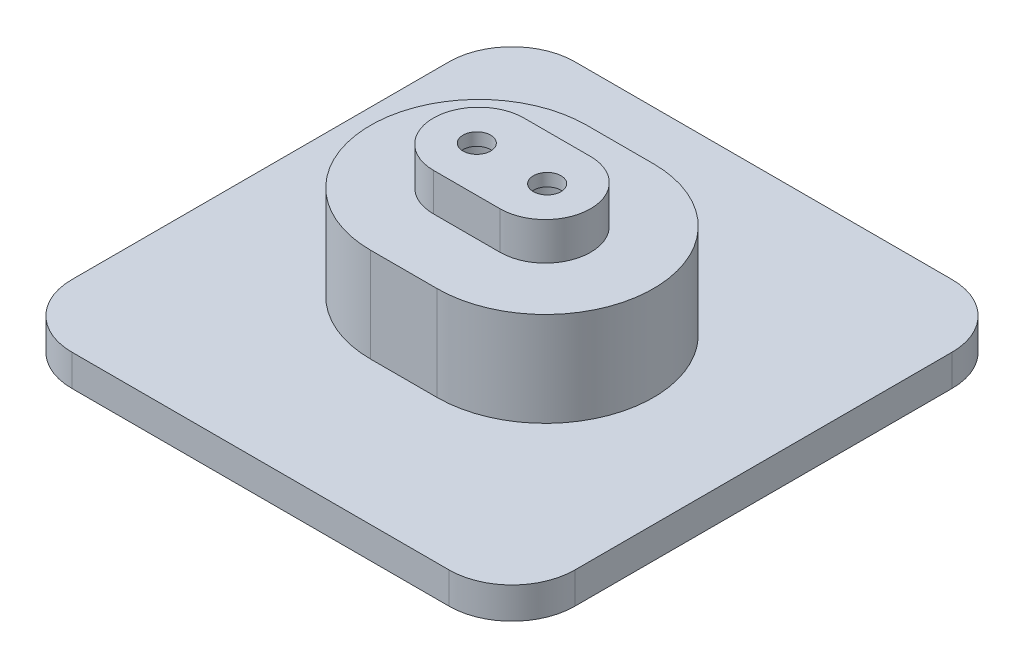
ISO-10303-21;
HEADER;
FILE_DESCRIPTION(('STEP AP214'),'2;1');
FILE_NAME('part.step','',(''),(''),'','','');
FILE_SCHEMA(('AUTOMOTIVE_DESIGN { 1 0 10303 214 1 1 1 1 }'));
ENDSEC;
DATA;
#1=APPLICATION_CONTEXT('core data for automotive mechanical design processes');
#2=APPLICATION_PROTOCOL_DEFINITION('international standard','automotive_design',2000,#1);
#3=PRODUCT_CONTEXT('',#1,'mechanical');
#4=PRODUCT('Part','Part','',(#3));
#5=PRODUCT_RELATED_PRODUCT_CATEGORY('part','',(#4));
#6=PRODUCT_DEFINITION_FORMATION('','',#4);
#7=PRODUCT_DEFINITION_CONTEXT('part definition',#1,'design');
#8=PRODUCT_DEFINITION('design','',#6,#7);
#9=PRODUCT_DEFINITION_SHAPE('','',#8);
#10=(LENGTH_UNIT() NAMED_UNIT(*) SI_UNIT(.MILLI.,.METRE.));
#11=(NAMED_UNIT(*) PLANE_ANGLE_UNIT() SI_UNIT($,.RADIAN.));
#12=(NAMED_UNIT(*) SI_UNIT($,.STERADIAN.) SOLID_ANGLE_UNIT());
#13=UNCERTAINTY_MEASURE_WITH_UNIT(LENGTH_MEASURE(1.E-05),#10,'distance_accuracy_value','');
#14=(GEOMETRIC_REPRESENTATION_CONTEXT(3) GLOBAL_UNCERTAINTY_ASSIGNED_CONTEXT((#13)) GLOBAL_UNIT_ASSIGNED_CONTEXT((#10,
#11,#12)) REPRESENTATION_CONTEXT('',''));
#15=CARTESIAN_POINT('',(0.,0.,0.));
#16=DIRECTION('',(0.,0.,1.));
#17=DIRECTION('',(1.,0.,0.));
#18=AXIS2_PLACEMENT_3D('',#15,#16,#17);
#19=CARTESIAN_POINT('',(-5.595,-1.00000000000001,0.));
#20=DIRECTION('',(0.,1.,0.));
#21=DIRECTION('',(0.,0.,1.));
#22=AXIS2_PLACEMENT_3D('',#19,#20,#21);
#23=CYLINDRICAL_SURFACE('',#22,2.2);
#24=CARTESIAN_POINT('',(-5.595,26.,0.));
#25=DIRECTION('',(0.,1.,0.));
#26=DIRECTION('',(0.,0.,1.));
#27=AXIS2_PLACEMENT_3D('',#24,#25,#26);
#28=CIRCLE('',#27,2.2);
#29=CARTESIAN_POINT('',(-5.595,26.,2.2));
#30=VERTEX_POINT('',#29);
#31=EDGE_CURVE('E337',#30,#30,#28,.T.);
#32=ORIENTED_EDGE('',*,*,#31,.T.);
#33=EDGE_LOOP('',(#32));
#34=FACE_BOUND('',#33,.T.);
#35=CARTESIAN_POINT('',(-5.595,24.,0.));
#36=DIRECTION('',(0.,-1.,0.));
#37=DIRECTION('',(0.,0.,-1.));
#38=AXIS2_PLACEMENT_3D('',#35,#36,#37);
#39=CIRCLE('',#38,2.2);
#40=CARTESIAN_POINT('',(-5.595,24.,-2.2));
#41=VERTEX_POINT('',#40);
#42=EDGE_CURVE('E53',#41,#41,#39,.F.);
#43=ORIENTED_EDGE('',*,*,#42,.F.);
#44=EDGE_LOOP('',(#43));
#45=FACE_BOUND('',#44,.T.);
#46=ADVANCED_FACE('F49',(#34,#45),#23,.F.);
#47=CARTESIAN_POINT('',(5.595,-1.00000000000001,0.));
#48=DIRECTION('',(0.,1.,0.));
#49=DIRECTION('',(0.,0.,1.));
#50=AXIS2_PLACEMENT_3D('',#47,#48,#49);
#51=CYLINDRICAL_SURFACE('',#50,2.2);
#52=CARTESIAN_POINT('',(5.595,26.,0.));
#53=DIRECTION('',(0.,1.,0.));
#54=DIRECTION('',(0.,0.,1.));
#55=AXIS2_PLACEMENT_3D('',#52,#53,#54);
#56=CIRCLE('',#55,2.2);
#57=CARTESIAN_POINT('',(5.595,26.,2.2));
#58=VERTEX_POINT('',#57);
#59=EDGE_CURVE('E189',#58,#58,#56,.T.);
#60=ORIENTED_EDGE('',*,*,#59,.T.);
#61=EDGE_LOOP('',(#60));
#62=FACE_BOUND('',#61,.T.);
#63=CARTESIAN_POINT('',(5.595,24.,0.));
#64=DIRECTION('',(0.,-1.,0.));
#65=DIRECTION('',(0.,0.,-1.));
#66=AXIS2_PLACEMENT_3D('',#63,#64,#65);
#67=CIRCLE('',#66,2.2);
#68=CARTESIAN_POINT('',(5.595,24.,-2.2));
#69=VERTEX_POINT('',#68);
#70=EDGE_CURVE('E328',#69,#69,#67,.F.);
#71=ORIENTED_EDGE('',*,*,#70,.F.);
#72=EDGE_LOOP('',(#71));
#73=FACE_BOUND('',#72,.T.);
#74=ADVANCED_FACE('F391',(#62,#73),#51,.F.);
#75=CARTESIAN_POINT('',(-30.,5.,30.));
#76=DIRECTION('',(0.,-1.,0.));
#77=DIRECTION('',(0.,0.,-1.));
#78=AXIS2_PLACEMENT_3D('',#75,#76,#77);
#79=PLANE('',#78);
#80=CARTESIAN_POINT('',(-30.,5.,30.));
#81=DIRECTION('',(0.,1.,0.));
#82=DIRECTION('',(0.,0.,-1.));
#83=AXIS2_PLACEMENT_3D('',#80,#81,#82);
#84=CIRCLE('',#83,10.);
#85=CARTESIAN_POINT('',(-40.,5.,29.9999999999999));
#86=VERTEX_POINT('',#85);
#87=CARTESIAN_POINT('',(-29.9999999999999,5.,40.));
#88=VERTEX_POINT('',#87);
#89=EDGE_CURVE('E253',#86,#88,#84,.T.);
#90=ORIENTED_EDGE('',*,*,#89,.T.);
#91=DIRECTION('',(1.,0.,0.));
#92=VECTOR('',#91,1.);
#93=CARTESIAN_POINT('',(29.9999999999999,5.,40.));
#94=LINE('',#93,#92);
#95=CARTESIAN_POINT('',(29.9999999999999,5.,40.));
#96=VERTEX_POINT('',#95);
#97=EDGE_CURVE('E257',#88,#96,#94,.T.);
#98=ORIENTED_EDGE('',*,*,#97,.T.);
#99=CARTESIAN_POINT('',(30.,5.,30.));
#100=DIRECTION('',(0.,1.,0.));
#101=DIRECTION('',(0.,0.,1.));
#102=AXIS2_PLACEMENT_3D('',#99,#100,#101);
#103=CIRCLE('',#102,10.);
#104=CARTESIAN_POINT('',(40.,5.,29.9999999999999));
#105=VERTEX_POINT('',#104);
#106=EDGE_CURVE('E261',#96,#105,#103,.T.);
#107=ORIENTED_EDGE('',*,*,#106,.T.);
#108=DIRECTION('',(0.,0.,-1.));
#109=VECTOR('',#108,1.);
#110=CARTESIAN_POINT('',(40.,5.,29.9999999999999));
#111=LINE('',#110,#109);
#112=CARTESIAN_POINT('',(40.,5.,-29.9999999999999));
#113=VERTEX_POINT('',#112);
#114=EDGE_CURVE('E264',#105,#113,#111,.T.);
#115=ORIENTED_EDGE('',*,*,#114,.T.);
#116=CARTESIAN_POINT('',(30.,5.,-30.));
#117=DIRECTION('',(0.,1.,0.));
#118=DIRECTION('',(0.,0.,1.));
#119=AXIS2_PLACEMENT_3D('',#116,#117,#118);
#120=CIRCLE('',#119,10.);
#121=CARTESIAN_POINT('',(29.9999999999999,5.,-40.));
#122=VERTEX_POINT('',#121);
#123=EDGE_CURVE('E267',#113,#122,#120,.T.);
#124=ORIENTED_EDGE('',*,*,#123,.T.);
#125=DIRECTION('',(-1.,0.,0.));
#126=VECTOR('',#125,1.);
#127=CARTESIAN_POINT('',(29.9999999999999,5.,-40.));
#128=LINE('',#127,#126);
#129=CARTESIAN_POINT('',(-29.9999999999999,5.,-40.));
#130=VERTEX_POINT('',#129);
#131=EDGE_CURVE('E270',#122,#130,#128,.T.);
#132=ORIENTED_EDGE('',*,*,#131,.T.);
#133=CARTESIAN_POINT('',(-30.,5.,-30.));
#134=DIRECTION('',(0.,1.,0.));
#135=DIRECTION('',(0.,0.,1.));
#136=AXIS2_PLACEMENT_3D('',#133,#134,#135);
#137=CIRCLE('',#136,10.);
#138=CARTESIAN_POINT('',(-40.,5.,-29.9999999999999));
#139=VERTEX_POINT('',#138);
#140=EDGE_CURVE('E273',#130,#139,#137,.T.);
#141=ORIENTED_EDGE('',*,*,#140,.T.);
#142=DIRECTION('',(0.,0.,1.));
#143=VECTOR('',#142,1.);
#144=CARTESIAN_POINT('',(-40.,5.,29.9999999999999));
#145=LINE('',#144,#143);
#146=EDGE_CURVE('E276',#139,#86,#145,.T.);
#147=ORIENTED_EDGE('',*,*,#146,.T.);
#148=EDGE_LOOP('',(#90,#98,#107,#115,#124,#132,#141,#147));
#149=FACE_BOUND('',#148,.T.);
#150=CARTESIAN_POINT('',(-5.29954084048259,5.,0.));
#151=DIRECTION('',(0.,1.,0.));
#152=DIRECTION('',(0.,0.,1.));
#153=AXIS2_PLACEMENT_3D('',#150,#151,#152);
#154=CIRCLE('',#153,17.2004591595174);
#155=CARTESIAN_POINT('',(-5.29954084048259,5.,-17.2004591595174));
#156=VERTEX_POINT('',#155);
#157=CARTESIAN_POINT('',(-5.29954084048259,5.,17.2004591595174));
#158=VERTEX_POINT('',#157);
#159=EDGE_CURVE('E221',#156,#158,#154,.T.);
#160=ORIENTED_EDGE('',*,*,#159,.F.);
#161=DIRECTION('',(-1.,0.,0.));
#162=VECTOR('',#161,1.);
#163=CARTESIAN_POINT('',(5.29954084048259,5.,-17.2004591595174));
#164=LINE('',#163,#162);
#165=CARTESIAN_POINT('',(5.29954084048259,5.,-17.2004591595174));
#166=VERTEX_POINT('',#165);
#167=EDGE_CURVE('E211',#166,#156,#164,.T.);
#168=ORIENTED_EDGE('',*,*,#167,.F.);
#169=CARTESIAN_POINT('',(5.29954084048259,5.,0.));
#170=DIRECTION('',(0.,1.,0.));
#171=DIRECTION('',(0.,0.,1.));
#172=AXIS2_PLACEMENT_3D('',#169,#170,#171);
#173=CIRCLE('',#172,17.2004591595174);
#174=CARTESIAN_POINT('',(5.29954084048259,5.,17.2004591595174));
#175=VERTEX_POINT('',#174);
#176=EDGE_CURVE('E230',#175,#166,#173,.T.);
#177=ORIENTED_EDGE('',*,*,#176,.F.);
#178=DIRECTION('',(1.,0.,0.));
#179=VECTOR('',#178,1.);
#180=CARTESIAN_POINT('',(-5.29954084048259,5.,17.2004591595174));
#181=LINE('',#180,#179);
#182=EDGE_CURVE('E225',#158,#175,#181,.T.);
#183=ORIENTED_EDGE('',*,*,#182,.F.);
#184=EDGE_LOOP('',(#160,#168,#177,#183));
#185=FACE_BOUND('',#184,.T.);
#186=ADVANCED_FACE('F396',(#149,#185),#79,.F.);
#187=CARTESIAN_POINT('',(-30.,5.,30.));
#188=DIRECTION('',(0.,-1.,0.));
#189=DIRECTION('',(0.,0.,-1.));
#190=AXIS2_PLACEMENT_3D('',#187,#188,#189);
#191=CYLINDRICAL_SURFACE('',#190,10.);
#192=CARTESIAN_POINT('',(-30.,0.,30.));
#193=DIRECTION('',(0.,1.,0.));
#194=DIRECTION('',(0.,0.,-1.));
#195=AXIS2_PLACEMENT_3D('',#192,#193,#194);
#196=CIRCLE('',#195,10.);
#197=CARTESIAN_POINT('',(-40.,0.,29.9999999999999));
#198=VERTEX_POINT('',#197);
#199=CARTESIAN_POINT('',(-29.9999999999999,0.,40.));
#200=VERTEX_POINT('',#199);
#201=EDGE_CURVE('E252',#198,#200,#196,.T.);
#202=ORIENTED_EDGE('',*,*,#201,.T.);
#203=DIRECTION('',(0.,-1.,0.));
#204=VECTOR('',#203,1.);
#205=CARTESIAN_POINT('',(-29.9999999999999,5.,40.));
#206=LINE('',#205,#204);
#207=EDGE_CURVE('E12',#88,#200,#206,.T.);
#208=ORIENTED_EDGE('',*,*,#207,.F.);
#209=ORIENTED_EDGE('',*,*,#89,.F.);
#210=DIRECTION('',(0.,-1.,0.));
#211=VECTOR('',#210,1.);
#212=CARTESIAN_POINT('',(-40.,5.,29.9999999999999));
#213=LINE('',#212,#211);
#214=EDGE_CURVE('E279',#86,#198,#213,.T.);
#215=ORIENTED_EDGE('',*,*,#214,.T.);
#216=EDGE_LOOP('',(#202,#208,#209,#215));
#217=FACE_BOUND('',#216,.T.);
#218=ADVANCED_FACE('F51',(#217),#191,.T.);
#219=CARTESIAN_POINT('',(29.9999999999999,5.,40.));
#220=DIRECTION('',(0.,0.,-1.));
#221=DIRECTION('',(-1.,0.,0.));
#222=AXIS2_PLACEMENT_3D('',#219,#220,#221);
#223=PLANE('',#222);
#224=DIRECTION('',(1.,0.,0.));
#225=VECTOR('',#224,1.);
#226=CARTESIAN_POINT('',(29.9999999999999,0.,40.));
#227=LINE('',#226,#225);
#228=CARTESIAN_POINT('',(29.9999999999999,0.,40.));
#229=VERTEX_POINT('',#228);
#230=EDGE_CURVE('E283',#200,#229,#227,.T.);
#231=ORIENTED_EDGE('',*,*,#230,.T.);
#232=DIRECTION('',(0.,-1.,0.));
#233=VECTOR('',#232,1.);
#234=CARTESIAN_POINT('',(29.9999999999999,5.,40.));
#235=LINE('',#234,#233);
#236=EDGE_CURVE('E59',#96,#229,#235,.T.);
#237=ORIENTED_EDGE('',*,*,#236,.F.);
#238=ORIENTED_EDGE('',*,*,#97,.F.);
#239=ORIENTED_EDGE('',*,*,#207,.T.);
#240=EDGE_LOOP('',(#231,#237,#238,#239));
#241=FACE_BOUND('',#240,.T.);
#242=ADVANCED_FACE('F458',(#241),#223,.F.);
#243=CARTESIAN_POINT('',(30.,5.,30.));
#244=DIRECTION('',(0.,-1.,0.));
#245=DIRECTION('',(0.,0.,-1.));
#246=AXIS2_PLACEMENT_3D('',#243,#244,#245);
#247=CYLINDRICAL_SURFACE('',#246,10.);
#248=CARTESIAN_POINT('',(30.,0.,30.));
#249=DIRECTION('',(0.,1.,0.));
#250=DIRECTION('',(0.,0.,1.));
#251=AXIS2_PLACEMENT_3D('',#248,#249,#250);
#252=CIRCLE('',#251,10.);
#253=CARTESIAN_POINT('',(40.,0.,29.9999999999999));
#254=VERTEX_POINT('',#253);
#255=EDGE_CURVE('E286',#229,#254,#252,.T.);
#256=ORIENTED_EDGE('',*,*,#255,.T.);
#257=DIRECTION('',(0.,-1.,0.));
#258=VECTOR('',#257,1.);
#259=CARTESIAN_POINT('',(40.,5.,29.9999999999999));
#260=LINE('',#259,#258);
#261=EDGE_CURVE('E322',#105,#254,#260,.T.);
#262=ORIENTED_EDGE('',*,*,#261,.F.);
#263=ORIENTED_EDGE('',*,*,#106,.F.);
#264=ORIENTED_EDGE('',*,*,#236,.T.);
#265=EDGE_LOOP('',(#256,#262,#263,#264));
#266=FACE_BOUND('',#265,.T.);
#267=ADVANCED_FACE('F454',(#266),#247,.T.);
#268=CARTESIAN_POINT('',(40.,5.,29.9999999999999));
#269=DIRECTION('',(-1.,0.,0.));
#270=DIRECTION('',(0.,0.,1.));
#271=AXIS2_PLACEMENT_3D('',#268,#269,#270);
#272=PLANE('',#271);
#273=DIRECTION('',(0.,0.,-1.));
#274=VECTOR('',#273,1.);
#275=CARTESIAN_POINT('',(40.,0.,29.9999999999999));
#276=LINE('',#275,#274);
#277=CARTESIAN_POINT('',(40.,0.,-29.9999999999999));
#278=VERTEX_POINT('',#277);
#279=EDGE_CURVE('E289',#254,#278,#276,.T.);
#280=ORIENTED_EDGE('',*,*,#279,.T.);
#281=DIRECTION('',(0.,-1.,0.));
#282=VECTOR('',#281,1.);
#283=CARTESIAN_POINT('',(40.,5.,-29.9999999999999));
#284=LINE('',#283,#282);
#285=EDGE_CURVE('E318',#113,#278,#284,.T.);
#286=ORIENTED_EDGE('',*,*,#285,.F.);
#287=ORIENTED_EDGE('',*,*,#114,.F.);
#288=ORIENTED_EDGE('',*,*,#261,.T.);
#289=EDGE_LOOP('',(#280,#286,#287,#288));
#290=FACE_BOUND('',#289,.T.);
#291=ADVANCED_FACE('F451',(#290),#272,.F.);
#292=CARTESIAN_POINT('',(30.,5.,-30.));
#293=DIRECTION('',(0.,-1.,0.));
#294=DIRECTION('',(0.,0.,-1.));
#295=AXIS2_PLACEMENT_3D('',#292,#293,#294);
#296=CYLINDRICAL_SURFACE('',#295,10.);
#297=CARTESIAN_POINT('',(30.,0.,-30.));
#298=DIRECTION('',(0.,1.,0.));
#299=DIRECTION('',(0.,0.,1.));
#300=AXIS2_PLACEMENT_3D('',#297,#298,#299);
#301=CIRCLE('',#300,10.);
#302=CARTESIAN_POINT('',(29.9999999999999,0.,-40.));
#303=VERTEX_POINT('',#302);
#304=EDGE_CURVE('E292',#278,#303,#301,.T.);
#305=ORIENTED_EDGE('',*,*,#304,.T.);
#306=DIRECTION('',(0.,-1.,0.));
#307=VECTOR('',#306,1.);
#308=CARTESIAN_POINT('',(29.9999999999999,5.,-40.));
#309=LINE('',#308,#307);
#310=EDGE_CURVE('E314',#122,#303,#309,.T.);
#311=ORIENTED_EDGE('',*,*,#310,.F.);
#312=ORIENTED_EDGE('',*,*,#123,.F.);
#313=ORIENTED_EDGE('',*,*,#285,.T.);
#314=EDGE_LOOP('',(#305,#311,#312,#313));
#315=FACE_BOUND('',#314,.T.);
#316=ADVANCED_FACE('F447',(#315),#296,.T.);
#317=CARTESIAN_POINT('',(29.9999999999999,5.,-40.));
#318=DIRECTION('',(0.,0.,1.));
#319=DIRECTION('',(1.,0.,0.));
#320=AXIS2_PLACEMENT_3D('',#317,#318,#319);
#321=PLANE('',#320);
#322=DIRECTION('',(-1.,0.,0.));
#323=VECTOR('',#322,1.);
#324=CARTESIAN_POINT('',(29.9999999999999,0.,-40.));
#325=LINE('',#324,#323);
#326=CARTESIAN_POINT('',(-29.9999999999999,0.,-40.));
#327=VERTEX_POINT('',#326);
#328=EDGE_CURVE('E295',#303,#327,#325,.T.);
#329=ORIENTED_EDGE('',*,*,#328,.T.);
#330=DIRECTION('',(0.,-1.,0.));
#331=VECTOR('',#330,1.);
#332=CARTESIAN_POINT('',(-29.9999999999999,5.,-40.));
#333=LINE('',#332,#331);
#334=EDGE_CURVE('E310',#130,#327,#333,.T.);
#335=ORIENTED_EDGE('',*,*,#334,.F.);
#336=ORIENTED_EDGE('',*,*,#131,.F.);
#337=ORIENTED_EDGE('',*,*,#310,.T.);
#338=EDGE_LOOP('',(#329,#335,#336,#337));
#339=FACE_BOUND('',#338,.T.);
#340=ADVANCED_FACE('F442',(#339),#321,.F.);
#341=CARTESIAN_POINT('',(-30.,5.,-30.));
#342=DIRECTION('',(0.,-1.,0.));
#343=DIRECTION('',(0.,0.,-1.));
#344=AXIS2_PLACEMENT_3D('',#341,#342,#343);
#345=CYLINDRICAL_SURFACE('',#344,10.);
#346=CARTESIAN_POINT('',(-30.,0.,-30.));
#347=DIRECTION('',(0.,1.,0.));
#348=DIRECTION('',(0.,0.,1.));
#349=AXIS2_PLACEMENT_3D('',#346,#347,#348);
#350=CIRCLE('',#349,10.);
#351=CARTESIAN_POINT('',(-40.,0.,-29.9999999999999));
#352=VERTEX_POINT('',#351);
#353=EDGE_CURVE('E298',#327,#352,#350,.T.);
#354=ORIENTED_EDGE('',*,*,#353,.T.);
#355=DIRECTION('',(0.,-1.,0.));
#356=VECTOR('',#355,1.);
#357=CARTESIAN_POINT('',(-40.,5.,-29.9999999999999));
#358=LINE('',#357,#356);
#359=EDGE_CURVE('E306',#139,#352,#358,.T.);
#360=ORIENTED_EDGE('',*,*,#359,.F.);
#361=ORIENTED_EDGE('',*,*,#140,.F.);
#362=ORIENTED_EDGE('',*,*,#334,.T.);
#363=EDGE_LOOP('',(#354,#360,#361,#362));
#364=FACE_BOUND('',#363,.T.);
#365=ADVANCED_FACE('F436',(#364),#345,.T.);
#366=CARTESIAN_POINT('',(-40.,5.,29.9999999999999));
#367=DIRECTION('',(1.,0.,0.));
#368=DIRECTION('',(0.,0.,-1.));
#369=AXIS2_PLACEMENT_3D('',#366,#367,#368);
#370=PLANE('',#369);
#371=DIRECTION('',(0.,0.,1.));
#372=VECTOR('',#371,1.);
#373=CARTESIAN_POINT('',(-40.,0.,29.9999999999999));
#374=LINE('',#373,#372);
#375=EDGE_CURVE('E258',#352,#198,#374,.T.);
#376=ORIENTED_EDGE('',*,*,#375,.T.);
#377=ORIENTED_EDGE('',*,*,#214,.F.);
#378=ORIENTED_EDGE('',*,*,#146,.F.);
#379=ORIENTED_EDGE('',*,*,#359,.T.);
#380=EDGE_LOOP('',(#376,#377,#378,#379));
#381=FACE_BOUND('',#380,.T.);
#382=ADVANCED_FACE('F419',(#381),#370,.F.);
#383=CARTESIAN_POINT('',(-30.,0.,30.));
#384=DIRECTION('',(0.,-1.,0.));
#385=DIRECTION('',(0.,0.,-1.));
#386=AXIS2_PLACEMENT_3D('',#383,#384,#385);
#387=PLANE('',#386);
#388=CARTESIAN_POINT('',(5.595,0.,0.));
#389=DIRECTION('',(0.,-1.,0.));
#390=DIRECTION('',(0.,0.,-1.));
#391=AXIS2_PLACEMENT_3D('',#388,#389,#390);
#392=CIRCLE('',#391,4.1);
#393=CARTESIAN_POINT('',(5.595,0.,-4.1));
#394=VERTEX_POINT('',#393);
#395=EDGE_CURVE('E339',#394,#394,#392,.T.);
#396=ORIENTED_EDGE('',*,*,#395,.F.);
#397=EDGE_LOOP('',(#396));
#398=FACE_BOUND('',#397,.T.);
#399=CARTESIAN_POINT('',(-5.595,0.,0.));
#400=DIRECTION('',(0.,-1.,0.));
#401=DIRECTION('',(0.,0.,-1.));
#402=AXIS2_PLACEMENT_3D('',#399,#400,#401);
#403=CIRCLE('',#402,4.1);
#404=CARTESIAN_POINT('',(-5.595,0.,-4.1));
#405=VERTEX_POINT('',#404);
#406=EDGE_CURVE('E345',#405,#405,#403,.T.);
#407=ORIENTED_EDGE('',*,*,#406,.F.);
#408=EDGE_LOOP('',(#407));
#409=FACE_BOUND('',#408,.T.);
#410=ORIENTED_EDGE('',*,*,#201,.F.);
#411=ORIENTED_EDGE('',*,*,#375,.F.);
#412=ORIENTED_EDGE('',*,*,#353,.F.);
#413=ORIENTED_EDGE('',*,*,#328,.F.);
#414=ORIENTED_EDGE('',*,*,#304,.F.);
#415=ORIENTED_EDGE('',*,*,#279,.F.);
#416=ORIENTED_EDGE('',*,*,#255,.F.);
#417=ORIENTED_EDGE('',*,*,#230,.F.);
#418=EDGE_LOOP('',(#410,#411,#412,#413,#414,#415,#416,#417));
#419=FACE_BOUND('',#418,.T.);
#420=ADVANCED_FACE('F415',(#398,#409,#419),#387,.T.);
#421=CARTESIAN_POINT('',(-5.29954084048259,20.,0.));
#422=DIRECTION('',(0.,-1.,0.));
#423=DIRECTION('',(0.,0.,-1.));
#424=AXIS2_PLACEMENT_3D('',#421,#422,#423);
#425=CYLINDRICAL_SURFACE('',#424,17.2004591595174);
#426=ORIENTED_EDGE('',*,*,#159,.T.);
#427=DIRECTION('',(0.,-1.,0.));
#428=VECTOR('',#427,1.);
#429=CARTESIAN_POINT('',(-5.29954084048259,20.,17.2004591595174));
#430=LINE('',#429,#428);
#431=CARTESIAN_POINT('',(-5.29954084048259,20.,17.2004591595174));
#432=VERTEX_POINT('',#431);
#433=EDGE_CURVE('E248',#432,#158,#430,.T.);
#434=ORIENTED_EDGE('',*,*,#433,.F.);
#435=CARTESIAN_POINT('',(-5.29954084048259,20.,0.));
#436=DIRECTION('',(0.,1.,0.));
#437=DIRECTION('',(0.,0.,1.));
#438=AXIS2_PLACEMENT_3D('',#435,#436,#437);
#439=CIRCLE('',#438,17.2004591595174);
#440=CARTESIAN_POINT('',(-5.29954084048259,20.,-17.2004591595174));
#441=VERTEX_POINT('',#440);
#442=EDGE_CURVE('E206',#441,#432,#439,.T.);
#443=ORIENTED_EDGE('',*,*,#442,.F.);
#444=DIRECTION('',(0.,-1.,0.));
#445=VECTOR('',#444,1.);
#446=CARTESIAN_POINT('',(-5.29954084048259,20.,-17.2004591595174));
#447=LINE('',#446,#445);
#448=EDGE_CURVE('E220',#441,#156,#447,.T.);
#449=ORIENTED_EDGE('',*,*,#448,.T.);
#450=EDGE_LOOP('',(#426,#434,#443,#449));
#451=FACE_BOUND('',#450,.T.);
#452=ADVANCED_FACE('F418',(#451),#425,.T.);
#453=CARTESIAN_POINT('',(-5.29954084048259,20.,17.2004591595174));
#454=DIRECTION('',(0.,0.,-1.));
#455=DIRECTION('',(-1.,0.,0.));
#456=AXIS2_PLACEMENT_3D('',#453,#454,#455);
#457=PLANE('',#456);
#458=ORIENTED_EDGE('',*,*,#182,.T.);
#459=DIRECTION('',(0.,-1.,0.));
#460=VECTOR('',#459,1.);
#461=CARTESIAN_POINT('',(5.29954084048259,20.,17.2004591595174));
#462=LINE('',#461,#460);
#463=CARTESIAN_POINT('',(5.29954084048259,20.,17.2004591595174));
#464=VERTEX_POINT('',#463);
#465=EDGE_CURVE('E244',#464,#175,#462,.T.);
#466=ORIENTED_EDGE('',*,*,#465,.F.);
#467=DIRECTION('',(1.,0.,0.));
#468=VECTOR('',#467,1.);
#469=CARTESIAN_POINT('',(-5.29954084048259,20.,17.2004591595174));
#470=LINE('',#469,#468);
#471=EDGE_CURVE('E210',#432,#464,#470,.T.);
#472=ORIENTED_EDGE('',*,*,#471,.F.);
#473=ORIENTED_EDGE('',*,*,#433,.T.);
#474=EDGE_LOOP('',(#458,#466,#472,#473));
#475=FACE_BOUND('',#474,.T.);
#476=ADVANCED_FACE('F476',(#475),#457,.F.);
#477=CARTESIAN_POINT('',(5.29954084048259,20.,0.));
#478=DIRECTION('',(0.,-1.,0.));
#479=DIRECTION('',(0.,0.,-1.));
#480=AXIS2_PLACEMENT_3D('',#477,#478,#479);
#481=CYLINDRICAL_SURFACE('',#480,17.2004591595174);
#482=ORIENTED_EDGE('',*,*,#176,.T.);
#483=DIRECTION('',(0.,-1.,0.));
#484=VECTOR('',#483,1.);
#485=CARTESIAN_POINT('',(5.29954084048259,20.,-17.2004591595174));
#486=LINE('',#485,#484);
#487=CARTESIAN_POINT('',(5.29954084048259,20.,-17.2004591595174));
#488=VERTEX_POINT('',#487);
#489=EDGE_CURVE('E240',#488,#166,#486,.T.);
#490=ORIENTED_EDGE('',*,*,#489,.F.);
#491=CARTESIAN_POINT('',(5.29954084048259,20.,0.));
#492=DIRECTION('',(0.,1.,0.));
#493=DIRECTION('',(0.,0.,1.));
#494=AXIS2_PLACEMENT_3D('',#491,#492,#493);
#495=CIRCLE('',#494,17.2004591595174);
#496=EDGE_CURVE('E214',#464,#488,#495,.T.);
#497=ORIENTED_EDGE('',*,*,#496,.F.);
#498=ORIENTED_EDGE('',*,*,#465,.T.);
#499=EDGE_LOOP('',(#482,#490,#497,#498));
#500=FACE_BOUND('',#499,.T.);
#501=ADVANCED_FACE('F474',(#500),#481,.T.);
#502=CARTESIAN_POINT('',(5.29954084048259,20.,-17.2004591595174));
#503=DIRECTION('',(0.,0.,1.));
#504=DIRECTION('',(1.,0.,0.));
#505=AXIS2_PLACEMENT_3D('',#502,#503,#504);
#506=PLANE('',#505);
#507=ORIENTED_EDGE('',*,*,#167,.T.);
#508=ORIENTED_EDGE('',*,*,#448,.F.);
#509=DIRECTION('',(-1.,0.,0.));
#510=VECTOR('',#509,1.);
#511=CARTESIAN_POINT('',(5.29954084048259,20.,-17.2004591595174));
#512=LINE('',#511,#510);
#513=EDGE_CURVE('E217',#488,#441,#512,.T.);
#514=ORIENTED_EDGE('',*,*,#513,.F.);
#515=ORIENTED_EDGE('',*,*,#489,.T.);
#516=EDGE_LOOP('',(#507,#508,#514,#515));
#517=FACE_BOUND('',#516,.T.);
#518=ADVANCED_FACE('F467',(#517),#506,.F.);
#519=CARTESIAN_POINT('',(-5.29954084048259,20.,0.));
#520=DIRECTION('',(0.,1.,0.));
#521=DIRECTION('',(0.,0.,1.));
#522=AXIS2_PLACEMENT_3D('',#519,#520,#521);
#523=PLANE('',#522);
#524=CARTESIAN_POINT('',(-5.29954084048259,20.,0.));
#525=DIRECTION('',(0.,1.,0.));
#526=DIRECTION('',(0.,0.,1.));
#527=AXIS2_PLACEMENT_3D('',#524,#525,#526);
#528=CIRCLE('',#527,7.20045915951741);
#529=CARTESIAN_POINT('',(-5.29954084048259,20.,-7.20045915951741));
#530=VERTEX_POINT('',#529);
#531=CARTESIAN_POINT('',(-5.29954084048259,20.,7.20045915951741));
#532=VERTEX_POINT('',#531);
#533=EDGE_CURVE('E67',#530,#532,#528,.T.);
#534=ORIENTED_EDGE('',*,*,#533,.F.);
#535=DIRECTION('',(-1.,0.,0.));
#536=VECTOR('',#535,1.);
#537=CARTESIAN_POINT('',(5.29954084048259,20.,-7.20045915951741));
#538=LINE('',#537,#536);
#539=CARTESIAN_POINT('',(5.29954084048259,20.,-7.20045915951741));
#540=VERTEX_POINT('',#539);
#541=EDGE_CURVE('E72',#540,#530,#538,.T.);
#542=ORIENTED_EDGE('',*,*,#541,.F.);
#543=CARTESIAN_POINT('',(5.29954084048259,20.,0.));
#544=DIRECTION('',(0.,1.,0.));
#545=DIRECTION('',(0.,0.,1.));
#546=AXIS2_PLACEMENT_3D('',#543,#544,#545);
#547=CIRCLE('',#546,7.20045915951741);
#548=CARTESIAN_POINT('',(5.29954084048259,20.,7.20045915951741));
#549=VERTEX_POINT('',#548);
#550=EDGE_CURVE('E162',#549,#540,#547,.T.);
#551=ORIENTED_EDGE('',*,*,#550,.F.);
#552=DIRECTION('',(1.,0.,0.));
#553=VECTOR('',#552,1.);
#554=CARTESIAN_POINT('',(-5.29954084048259,20.,7.20045915951741));
#555=LINE('',#554,#553);
#556=EDGE_CURVE('E167',#532,#549,#555,.T.);
#557=ORIENTED_EDGE('',*,*,#556,.F.);
#558=EDGE_LOOP('',(#534,#542,#551,#557));
#559=FACE_BOUND('',#558,.T.);
#560=ORIENTED_EDGE('',*,*,#442,.T.);
#561=ORIENTED_EDGE('',*,*,#471,.T.);
#562=ORIENTED_EDGE('',*,*,#496,.T.);
#563=ORIENTED_EDGE('',*,*,#513,.T.);
#564=EDGE_LOOP('',(#560,#561,#562,#563));
#565=FACE_BOUND('',#564,.T.);
#566=ADVANCED_FACE('F164',(#559,#565),#523,.T.);
#567=CARTESIAN_POINT('',(5.29954084048259,54.8511082704203,-7.20045915951741));
#568=DIRECTION('',(0.,0.,1.));
#569=DIRECTION('',(1.,0.,0.));
#570=AXIS2_PLACEMENT_3D('',#567,#568,#569);
#571=PLANE('',#570);
#572=DIRECTION('',(0.,-1.,0.));
#573=VECTOR('',#572,1.);
#574=CARTESIAN_POINT('',(-5.29954084048259,54.8511082704203,-7.20045915951741));
#575=LINE('',#574,#573);
#576=CARTESIAN_POINT('',(-5.29954084048259,26.,-7.20045915951741));
#577=VERTEX_POINT('',#576);
#578=EDGE_CURVE('E195',#577,#530,#575,.T.);
#579=ORIENTED_EDGE('',*,*,#578,.F.);
#580=DIRECTION('',(1.,0.,0.));
#581=VECTOR('',#580,1.);
#582=CARTESIAN_POINT('',(5.29954084048259,26.,-7.20045915951741));
#583=LINE('',#582,#581);
#584=CARTESIAN_POINT('',(5.29954084048259,26.,-7.20045915951741));
#585=VERTEX_POINT('',#584);
#586=EDGE_CURVE('E202',#577,#585,#583,.T.);
#587=ORIENTED_EDGE('',*,*,#586,.T.);
#588=DIRECTION('',(0.,-1.,0.));
#589=VECTOR('',#588,1.);
#590=CARTESIAN_POINT('',(5.29954084048259,54.8511082704203,-7.20045915951741));
#591=LINE('',#590,#589);
#592=EDGE_CURVE('E182',#585,#540,#591,.T.);
#593=ORIENTED_EDGE('',*,*,#592,.T.);
#594=ORIENTED_EDGE('',*,*,#541,.T.);
#595=EDGE_LOOP('',(#579,#587,#593,#594));
#596=FACE_BOUND('',#595,.T.);
#597=ADVANCED_FACE('F372',(#596),#571,.F.);
#598=CARTESIAN_POINT('',(5.29954084048259,54.8511082704203,0.));
#599=DIRECTION('',(0.,-1.,0.));
#600=DIRECTION('',(0.,0.,-1.));
#601=AXIS2_PLACEMENT_3D('',#598,#599,#600);
#602=CYLINDRICAL_SURFACE('',#601,7.20045915951741);
#603=ORIENTED_EDGE('',*,*,#592,.F.);
#604=CARTESIAN_POINT('',(5.29954084048259,26.,0.));
#605=DIRECTION('',(0.,-1.,0.));
#606=DIRECTION('',(0.,0.,-1.));
#607=AXIS2_PLACEMENT_3D('',#604,#605,#606);
#608=CIRCLE('',#607,7.20045915951741);
#609=CARTESIAN_POINT('',(5.29954084048259,26.,7.20045915951741));
#610=VERTEX_POINT('',#609);
#611=EDGE_CURVE('E177',#585,#610,#608,.T.);
#612=ORIENTED_EDGE('',*,*,#611,.T.);
#613=DIRECTION('',(0.,-1.,0.));
#614=VECTOR('',#613,1.);
#615=CARTESIAN_POINT('',(5.29954084048259,54.8511082704203,7.20045915951741));
#616=LINE('',#615,#614);
#617=EDGE_CURVE('E175',#610,#549,#616,.T.);
#618=ORIENTED_EDGE('',*,*,#617,.T.);
#619=ORIENTED_EDGE('',*,*,#550,.T.);
#620=EDGE_LOOP('',(#603,#612,#618,#619));
#621=FACE_BOUND('',#620,.T.);
#622=ADVANCED_FACE('F176',(#621),#602,.T.);
#623=CARTESIAN_POINT('',(-5.29954084048259,54.8511082704203,7.20045915951741));
#624=DIRECTION('',(0.,0.,-1.));
#625=DIRECTION('',(-1.,0.,0.));
#626=AXIS2_PLACEMENT_3D('',#623,#624,#625);
#627=PLANE('',#626);
#628=ORIENTED_EDGE('',*,*,#617,.F.);
#629=DIRECTION('',(-1.,0.,0.));
#630=VECTOR('',#629,1.);
#631=CARTESIAN_POINT('',(-5.29954084048259,26.,7.20045915951741));
#632=LINE('',#631,#630);
#633=CARTESIAN_POINT('',(-5.29954084048259,26.,7.20045915951741));
#634=VERTEX_POINT('',#633);
#635=EDGE_CURVE('E363',#610,#634,#632,.T.);
#636=ORIENTED_EDGE('',*,*,#635,.T.);
#637=DIRECTION('',(0.,-1.,0.));
#638=VECTOR('',#637,1.);
#639=CARTESIAN_POINT('',(-5.29954084048259,54.8511082704203,7.20045915951741));
#640=LINE('',#639,#638);
#641=EDGE_CURVE('E181',#634,#532,#640,.T.);
#642=ORIENTED_EDGE('',*,*,#641,.T.);
#643=ORIENTED_EDGE('',*,*,#556,.T.);
#644=EDGE_LOOP('',(#628,#636,#642,#643));
#645=FACE_BOUND('',#644,.T.);
#646=ADVANCED_FACE('F184',(#645),#627,.F.);
#647=CARTESIAN_POINT('',(-5.29954084048259,54.8511082704203,0.));
#648=DIRECTION('',(0.,-1.,0.));
#649=DIRECTION('',(0.,0.,-1.));
#650=AXIS2_PLACEMENT_3D('',#647,#648,#649);
#651=CYLINDRICAL_SURFACE('',#650,7.20045915951741);
#652=ORIENTED_EDGE('',*,*,#641,.F.);
#653=CARTESIAN_POINT('',(-5.29954084048259,26.,0.));
#654=DIRECTION('',(0.,-1.,0.));
#655=DIRECTION('',(0.,0.,-1.));
#656=AXIS2_PLACEMENT_3D('',#653,#654,#655);
#657=CIRCLE('',#656,7.20045915951741);
#658=EDGE_CURVE('E226',#634,#577,#657,.T.);
#659=ORIENTED_EDGE('',*,*,#658,.T.);
#660=ORIENTED_EDGE('',*,*,#578,.T.);
#661=ORIENTED_EDGE('',*,*,#533,.T.);
#662=EDGE_LOOP('',(#652,#659,#660,#661));
#663=FACE_BOUND('',#662,.T.);
#664=ADVANCED_FACE('F369',(#663),#651,.T.);
#665=CARTESIAN_POINT('',(0.,26.,0.));
#666=DIRECTION('',(0.,-1.,0.));
#667=DIRECTION('',(0.,0.,-1.));
#668=AXIS2_PLACEMENT_3D('',#665,#666,#667);
#669=PLANE('',#668);
#670=ORIENTED_EDGE('',*,*,#59,.F.);
#671=EDGE_LOOP('',(#670));
#672=FACE_BOUND('',#671,.T.);
#673=ORIENTED_EDGE('',*,*,#31,.F.);
#674=EDGE_LOOP('',(#673));
#675=FACE_BOUND('',#674,.T.);
#676=ORIENTED_EDGE('',*,*,#635,.F.);
#677=ORIENTED_EDGE('',*,*,#611,.F.);
#678=ORIENTED_EDGE('',*,*,#586,.F.);
#679=ORIENTED_EDGE('',*,*,#658,.F.);
#680=EDGE_LOOP('',(#676,#677,#678,#679));
#681=FACE_BOUND('',#680,.T.);
#682=ADVANCED_FACE('F373',(#672,#675,#681),#669,.F.);
#683=CARTESIAN_POINT('',(0.,24.,0.));
#684=DIRECTION('',(0.,-1.,0.));
#685=DIRECTION('',(0.,0.,-1.));
#686=AXIS2_PLACEMENT_3D('',#683,#684,#685);
#687=PLANE('',#686);
#688=CARTESIAN_POINT('',(5.595,24.,0.));
#689=DIRECTION('',(0.,-1.,0.));
#690=DIRECTION('',(0.,0.,-1.));
#691=AXIS2_PLACEMENT_3D('',#688,#689,#690);
#692=CIRCLE('',#691,4.1);
#693=CARTESIAN_POINT('',(5.595,24.,-4.1));
#694=VERTEX_POINT('',#693);
#695=EDGE_CURVE('E331',#694,#694,#692,.F.);
#696=ORIENTED_EDGE('',*,*,#695,.F.);
#697=EDGE_LOOP('',(#696));
#698=FACE_BOUND('',#697,.T.);
#699=ORIENTED_EDGE('',*,*,#70,.T.);
#700=EDGE_LOOP('',(#699));
#701=FACE_BOUND('',#700,.T.);
#702=ADVANCED_FACE('F375',(#698,#701),#687,.T.);
#703=CARTESIAN_POINT('',(5.595,37.5965512114594,0.));
#704=DIRECTION('',(0.,-1.,0.));
#705=DIRECTION('',(0.,0.,-1.));
#706=AXIS2_PLACEMENT_3D('',#703,#704,#705);
#707=CYLINDRICAL_SURFACE('',#706,4.1);
#708=ORIENTED_EDGE('',*,*,#695,.T.);
#709=EDGE_LOOP('',(#708));
#710=FACE_BOUND('',#709,.T.);
#711=ORIENTED_EDGE('',*,*,#395,.T.);
#712=EDGE_LOOP('',(#711));
#713=FACE_BOUND('',#712,.T.);
#714=ADVANCED_FACE('F383',(#710,#713),#707,.F.);
#715=CARTESIAN_POINT('',(0.,24.,0.));
#716=DIRECTION('',(0.,-1.,0.));
#717=DIRECTION('',(0.,0.,-1.));
#718=AXIS2_PLACEMENT_3D('',#715,#716,#717);
#719=PLANE('',#718);
#720=CARTESIAN_POINT('',(-5.595,24.,0.));
#721=DIRECTION('',(0.,-1.,0.));
#722=DIRECTION('',(0.,0.,-1.));
#723=AXIS2_PLACEMENT_3D('',#720,#721,#722);
#724=CIRCLE('',#723,4.1);
#725=CARTESIAN_POINT('',(-5.595,24.,-4.1));
#726=VERTEX_POINT('',#725);
#727=EDGE_CURVE('E348',#726,#726,#724,.F.);
#728=ORIENTED_EDGE('',*,*,#727,.F.);
#729=EDGE_LOOP('',(#728));
#730=FACE_BOUND('',#729,.T.);
#731=ORIENTED_EDGE('',*,*,#42,.T.);
#732=EDGE_LOOP('',(#731));
#733=FACE_BOUND('',#732,.T.);
#734=ADVANCED_FACE('F401',(#730,#733),#719,.T.);
#735=CARTESIAN_POINT('',(-5.595,37.5965512114594,0.));
#736=DIRECTION('',(0.,-1.,0.));
#737=DIRECTION('',(0.,0.,-1.));
#738=AXIS2_PLACEMENT_3D('',#735,#736,#737);
#739=CYLINDRICAL_SURFACE('',#738,4.1);
#740=ORIENTED_EDGE('',*,*,#727,.T.);
#741=EDGE_LOOP('',(#740));
#742=FACE_BOUND('',#741,.T.);
#743=ORIENTED_EDGE('',*,*,#406,.T.);
#744=EDGE_LOOP('',(#743));
#745=FACE_BOUND('',#744,.T.);
#746=ADVANCED_FACE('F404',(#742,#745),#739,.F.);
#747=CLOSED_SHELL('',(#46,#74,#186,#218,#242,#267,#291,#316,#340,#365,#382,#420,#452,#476,#501,
#518,#566,#597,#622,#646,#664,#682,#702,#714,#734,#746));
#748=MANIFOLD_SOLID_BREP('B2',#747);
#749=ADVANCED_BREP_SHAPE_REPRESENTATION('',(#18,#748),#14);
#750=SHAPE_DEFINITION_REPRESENTATION(#9,#749);
ENDSEC;
END-ISO-10303-21;
